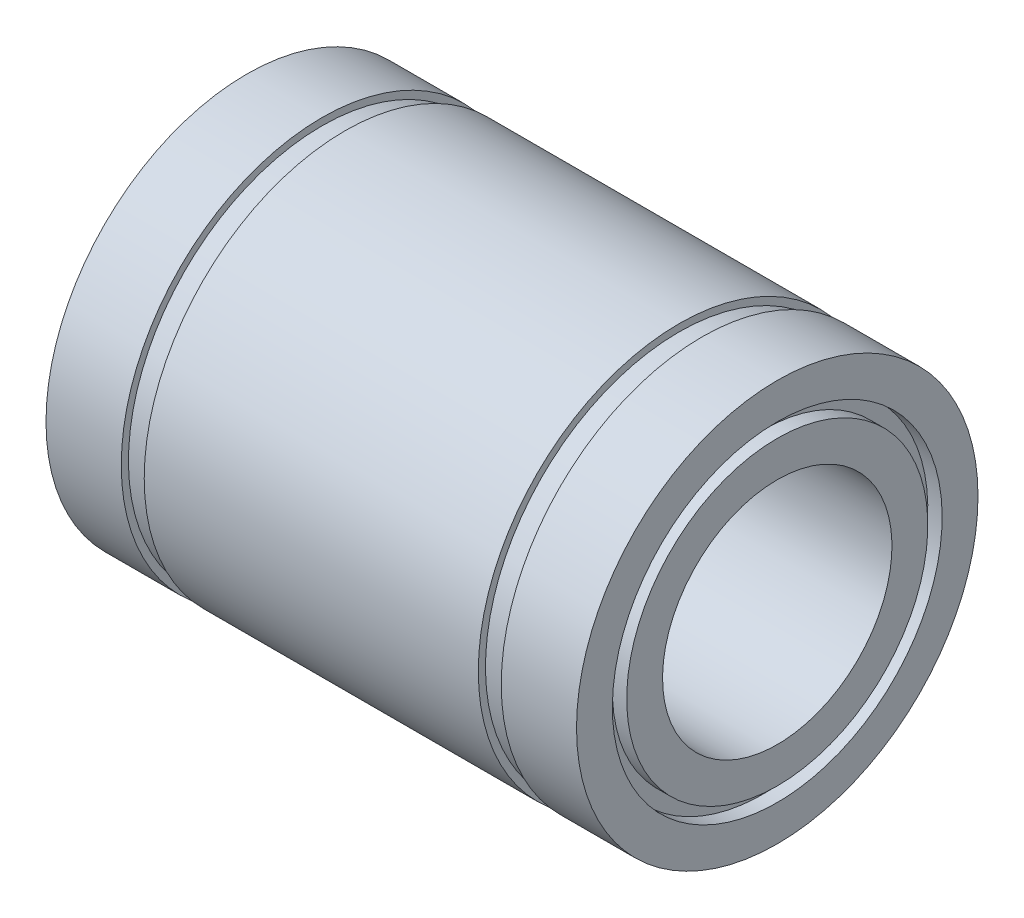
ISO-10303-21;
HEADER;
FILE_DESCRIPTION(('STEP AP214'),'2;1');
FILE_NAME('part.step','',(''),(''),'','','');
FILE_SCHEMA(('AUTOMOTIVE_DESIGN { 1 0 10303 214 1 1 1 1 }'));
ENDSEC;
DATA;
#1=APPLICATION_CONTEXT('core data for automotive mechanical design processes');
#2=APPLICATION_PROTOCOL_DEFINITION('international standard','automotive_design',2000,#1);
#3=PRODUCT_CONTEXT('',#1,'mechanical');
#4=PRODUCT('Part','Part','',(#3));
#5=PRODUCT_RELATED_PRODUCT_CATEGORY('part','',(#4));
#6=PRODUCT_DEFINITION_FORMATION('','',#4);
#7=PRODUCT_DEFINITION_CONTEXT('part definition',#1,'design');
#8=PRODUCT_DEFINITION('design','',#6,#7);
#9=PRODUCT_DEFINITION_SHAPE('','',#8);
#10=(LENGTH_UNIT() NAMED_UNIT(*) SI_UNIT(.MILLI.,.METRE.));
#11=(NAMED_UNIT(*) PLANE_ANGLE_UNIT() SI_UNIT($,.RADIAN.));
#12=(NAMED_UNIT(*) SI_UNIT($,.STERADIAN.) SOLID_ANGLE_UNIT());
#13=UNCERTAINTY_MEASURE_WITH_UNIT(LENGTH_MEASURE(1.E-05),#10,'distance_accuracy_value','');
#14=(GEOMETRIC_REPRESENTATION_CONTEXT(3) GLOBAL_UNCERTAINTY_ASSIGNED_CONTEXT((#13)) GLOBAL_UNIT_ASSIGNED_CONTEXT((#10,
#11,#12)) REPRESENTATION_CONTEXT('',''));
#15=CARTESIAN_POINT('',(0.,0.,0.));
#16=DIRECTION('',(0.,0.,1.));
#17=DIRECTION('',(1.,0.,0.));
#18=AXIS2_PLACEMENT_3D('',#15,#16,#17);
#19=CARTESIAN_POINT('',(-18.5,11.5,0.));
#20=DIRECTION('',(-1.,0.,0.));
#21=DIRECTION('',(0.,-1.,0.));
#22=AXIS2_PLACEMENT_3D('',#19,#20,#21);
#23=PLANE('',#22);
#24=CARTESIAN_POINT('',(-18.5,0.,0.));
#25=DIRECTION('',(1.,0.,0.));
#26=DIRECTION('',(0.,1.,0.));
#27=AXIS2_PLACEMENT_3D('',#24,#25,#26);
#28=CIRCLE('',#27,11.5);
#29=CARTESIAN_POINT('',(-18.5,11.5,0.));
#30=VERTEX_POINT('',#29);
#31=EDGE_CURVE('E121',#30,#30,#28,.T.);
#32=ORIENTED_EDGE('',*,*,#31,.T.);
#33=EDGE_LOOP('',(#32));
#34=FACE_BOUND('',#33,.T.);
#35=CARTESIAN_POINT('',(-18.5,0.,0.));
#36=DIRECTION('',(1.,0.,0.));
#37=DIRECTION('',(0.,1.,0.));
#38=AXIS2_PLACEMENT_3D('',#35,#36,#37);
#39=CIRCLE('',#38,14.);
#40=CARTESIAN_POINT('',(-18.5,14.,0.));
#41=VERTEX_POINT('',#40);
#42=EDGE_CURVE('E10',#41,#41,#39,.T.);
#43=ORIENTED_EDGE('',*,*,#42,.F.);
#44=EDGE_LOOP('',(#43));
#45=FACE_BOUND('',#44,.T.);
#46=ADVANCED_FACE('F38',(#34,#45),#23,.T.);
#47=CARTESIAN_POINT('',(0.,0.,0.));
#48=DIRECTION('',(1.,0.,0.));
#49=DIRECTION('',(0.,1.,0.));
#50=AXIS2_PLACEMENT_3D('',#47,#48,#49);
#51=CYLINDRICAL_SURFACE('',#50,14.);
#52=ORIENTED_EDGE('',*,*,#42,.T.);
#53=EDGE_LOOP('',(#52));
#54=FACE_BOUND('',#53,.T.);
#55=CARTESIAN_POINT('',(-13.25,0.,0.));
#56=DIRECTION('',(1.,0.,0.));
#57=DIRECTION('',(0.,1.,0.));
#58=AXIS2_PLACEMENT_3D('',#55,#56,#57);
#59=CIRCLE('',#58,14.);
#60=CARTESIAN_POINT('',(-13.25,14.,0.));
#61=VERTEX_POINT('',#60);
#62=EDGE_CURVE('E45',#61,#61,#59,.T.);
#63=ORIENTED_EDGE('',*,*,#62,.F.);
#64=EDGE_LOOP('',(#63));
#65=FACE_BOUND('',#64,.T.);
#66=ADVANCED_FACE('F140',(#54,#65),#51,.T.);
#67=CARTESIAN_POINT('',(-13.25,14.,0.));
#68=DIRECTION('',(1.,0.,0.));
#69=DIRECTION('',(0.,1.,0.));
#70=AXIS2_PLACEMENT_3D('',#67,#68,#69);
#71=PLANE('',#70);
#72=ORIENTED_EDGE('',*,*,#62,.T.);
#73=EDGE_LOOP('',(#72));
#74=FACE_BOUND('',#73,.T.);
#75=CARTESIAN_POINT('',(-13.25,0.,0.));
#76=DIRECTION('',(1.,0.,0.));
#77=DIRECTION('',(0.,1.,0.));
#78=AXIS2_PLACEMENT_3D('',#75,#76,#77);
#79=CIRCLE('',#78,13.5);
#80=CARTESIAN_POINT('',(-13.25,13.5,0.));
#81=VERTEX_POINT('',#80);
#82=EDGE_CURVE('E52',#81,#81,#79,.T.);
#83=ORIENTED_EDGE('',*,*,#82,.F.);
#84=EDGE_LOOP('',(#83));
#85=FACE_BOUND('',#84,.T.);
#86=ADVANCED_FACE('F144',(#74,#85),#71,.T.);
#87=CARTESIAN_POINT('',(0.,0.,0.));
#88=DIRECTION('',(1.,0.,0.));
#89=DIRECTION('',(0.,1.,0.));
#90=AXIS2_PLACEMENT_3D('',#87,#88,#89);
#91=CYLINDRICAL_SURFACE('',#90,13.5);
#92=ORIENTED_EDGE('',*,*,#82,.T.);
#93=EDGE_LOOP('',(#92));
#94=FACE_BOUND('',#93,.T.);
#95=CARTESIAN_POINT('',(-11.65,0.,0.));
#96=DIRECTION('',(1.,0.,0.));
#97=DIRECTION('',(0.,1.,0.));
#98=AXIS2_PLACEMENT_3D('',#95,#96,#97);
#99=CIRCLE('',#98,13.5);
#100=CARTESIAN_POINT('',(-11.65,13.5,0.));
#101=VERTEX_POINT('',#100);
#102=EDGE_CURVE('E58',#101,#101,#99,.T.);
#103=ORIENTED_EDGE('',*,*,#102,.F.);
#104=EDGE_LOOP('',(#103));
#105=FACE_BOUND('',#104,.T.);
#106=ADVANCED_FACE('F148',(#94,#105),#91,.T.);
#107=CARTESIAN_POINT('',(-11.65,13.5,0.));
#108=DIRECTION('',(-1.,0.,0.));
#109=DIRECTION('',(0.,-1.,0.));
#110=AXIS2_PLACEMENT_3D('',#107,#108,#109);
#111=PLANE('',#110);
#112=ORIENTED_EDGE('',*,*,#102,.T.);
#113=EDGE_LOOP('',(#112));
#114=FACE_BOUND('',#113,.T.);
#115=CARTESIAN_POINT('',(-11.65,0.,0.));
#116=DIRECTION('',(1.,0.,0.));
#117=DIRECTION('',(0.,1.,0.));
#118=AXIS2_PLACEMENT_3D('',#115,#116,#117);
#119=CIRCLE('',#118,14.);
#120=CARTESIAN_POINT('',(-11.65,14.,0.));
#121=VERTEX_POINT('',#120);
#122=EDGE_CURVE('E64',#121,#121,#119,.T.);
#123=ORIENTED_EDGE('',*,*,#122,.F.);
#124=EDGE_LOOP('',(#123));
#125=FACE_BOUND('',#124,.T.);
#126=ADVANCED_FACE('F154',(#114,#125),#111,.T.);
#127=CARTESIAN_POINT('',(0.,0.,0.));
#128=DIRECTION('',(1.,0.,0.));
#129=DIRECTION('',(0.,1.,0.));
#130=AXIS2_PLACEMENT_3D('',#127,#128,#129);
#131=CYLINDRICAL_SURFACE('',#130,14.);
#132=ORIENTED_EDGE('',*,*,#122,.T.);
#133=EDGE_LOOP('',(#132));
#134=FACE_BOUND('',#133,.T.);
#135=CARTESIAN_POINT('',(11.65,0.,0.));
#136=DIRECTION('',(1.,0.,0.));
#137=DIRECTION('',(0.,1.,0.));
#138=AXIS2_PLACEMENT_3D('',#135,#136,#137);
#139=CIRCLE('',#138,14.);
#140=CARTESIAN_POINT('',(11.65,14.,0.));
#141=VERTEX_POINT('',#140);
#142=EDGE_CURVE('E68',#141,#141,#139,.T.);
#143=ORIENTED_EDGE('',*,*,#142,.F.);
#144=EDGE_LOOP('',(#143));
#145=FACE_BOUND('',#144,.T.);
#146=ADVANCED_FACE('F158',(#134,#145),#131,.T.);
#147=CARTESIAN_POINT('',(11.65,14.,0.));
#148=DIRECTION('',(1.,0.,0.));
#149=DIRECTION('',(0.,1.,0.));
#150=AXIS2_PLACEMENT_3D('',#147,#148,#149);
#151=PLANE('',#150);
#152=ORIENTED_EDGE('',*,*,#142,.T.);
#153=EDGE_LOOP('',(#152));
#154=FACE_BOUND('',#153,.T.);
#155=CARTESIAN_POINT('',(11.65,0.,0.));
#156=DIRECTION('',(1.,0.,0.));
#157=DIRECTION('',(0.,1.,0.));
#158=AXIS2_PLACEMENT_3D('',#155,#156,#157);
#159=CIRCLE('',#158,13.5);
#160=CARTESIAN_POINT('',(11.65,13.5,0.));
#161=VERTEX_POINT('',#160);
#162=EDGE_CURVE('E72',#161,#161,#159,.T.);
#163=ORIENTED_EDGE('',*,*,#162,.F.);
#164=EDGE_LOOP('',(#163));
#165=FACE_BOUND('',#164,.T.);
#166=ADVANCED_FACE('F162',(#154,#165),#151,.T.);
#167=CARTESIAN_POINT('',(0.,0.,0.));
#168=DIRECTION('',(1.,0.,0.));
#169=DIRECTION('',(0.,1.,0.));
#170=AXIS2_PLACEMENT_3D('',#167,#168,#169);
#171=CYLINDRICAL_SURFACE('',#170,13.5);
#172=ORIENTED_EDGE('',*,*,#162,.T.);
#173=EDGE_LOOP('',(#172));
#174=FACE_BOUND('',#173,.T.);
#175=CARTESIAN_POINT('',(13.25,0.,0.));
#176=DIRECTION('',(1.,0.,0.));
#177=DIRECTION('',(0.,1.,0.));
#178=AXIS2_PLACEMENT_3D('',#175,#176,#177);
#179=CIRCLE('',#178,13.5);
#180=CARTESIAN_POINT('',(13.25,13.5,0.));
#181=VERTEX_POINT('',#180);
#182=EDGE_CURVE('E75',#181,#181,#179,.T.);
#183=ORIENTED_EDGE('',*,*,#182,.F.);
#184=EDGE_LOOP('',(#183));
#185=FACE_BOUND('',#184,.T.);
#186=ADVANCED_FACE('F166',(#174,#185),#171,.T.);
#187=CARTESIAN_POINT('',(13.25,13.5,0.));
#188=DIRECTION('',(-1.,0.,0.));
#189=DIRECTION('',(0.,-1.,0.));
#190=AXIS2_PLACEMENT_3D('',#187,#188,#189);
#191=PLANE('',#190);
#192=ORIENTED_EDGE('',*,*,#182,.T.);
#193=EDGE_LOOP('',(#192));
#194=FACE_BOUND('',#193,.T.);
#195=CARTESIAN_POINT('',(13.25,0.,0.));
#196=DIRECTION('',(1.,0.,0.));
#197=DIRECTION('',(0.,1.,0.));
#198=AXIS2_PLACEMENT_3D('',#195,#196,#197);
#199=CIRCLE('',#198,14.);
#200=CARTESIAN_POINT('',(13.25,14.,0.));
#201=VERTEX_POINT('',#200);
#202=EDGE_CURVE('E79',#201,#201,#199,.T.);
#203=ORIENTED_EDGE('',*,*,#202,.F.);
#204=EDGE_LOOP('',(#203));
#205=FACE_BOUND('',#204,.T.);
#206=ADVANCED_FACE('F170',(#194,#205),#191,.T.);
#207=CARTESIAN_POINT('',(0.,0.,0.));
#208=DIRECTION('',(1.,0.,0.));
#209=DIRECTION('',(0.,1.,0.));
#210=AXIS2_PLACEMENT_3D('',#207,#208,#209);
#211=CYLINDRICAL_SURFACE('',#210,14.);
#212=ORIENTED_EDGE('',*,*,#202,.T.);
#213=EDGE_LOOP('',(#212));
#214=FACE_BOUND('',#213,.T.);
#215=CARTESIAN_POINT('',(18.5,0.,0.));
#216=DIRECTION('',(1.,0.,0.));
#217=DIRECTION('',(0.,1.,0.));
#218=AXIS2_PLACEMENT_3D('',#215,#216,#217);
#219=CIRCLE('',#218,14.);
#220=CARTESIAN_POINT('',(18.5,14.,0.));
#221=VERTEX_POINT('',#220);
#222=EDGE_CURVE('E82',#221,#221,#219,.T.);
#223=ORIENTED_EDGE('',*,*,#222,.F.);
#224=EDGE_LOOP('',(#223));
#225=FACE_BOUND('',#224,.T.);
#226=ADVANCED_FACE('F174',(#214,#225),#211,.T.);
#227=CARTESIAN_POINT('',(18.5,14.,0.));
#228=DIRECTION('',(1.,0.,0.));
#229=DIRECTION('',(0.,1.,0.));
#230=AXIS2_PLACEMENT_3D('',#227,#228,#229);
#231=PLANE('',#230);
#232=ORIENTED_EDGE('',*,*,#222,.T.);
#233=EDGE_LOOP('',(#232));
#234=FACE_BOUND('',#233,.T.);
#235=CARTESIAN_POINT('',(18.5,0.,0.));
#236=DIRECTION('',(1.,0.,0.));
#237=DIRECTION('',(0.,1.,0.));
#238=AXIS2_PLACEMENT_3D('',#235,#236,#237);
#239=CIRCLE('',#238,11.5);
#240=CARTESIAN_POINT('',(18.5,11.5,0.));
#241=VERTEX_POINT('',#240);
#242=EDGE_CURVE('E86',#241,#241,#239,.T.);
#243=ORIENTED_EDGE('',*,*,#242,.F.);
#244=EDGE_LOOP('',(#243));
#245=FACE_BOUND('',#244,.T.);
#246=ADVANCED_FACE('F178',(#234,#245),#231,.T.);
#247=CARTESIAN_POINT('',(0.,0.,0.));
#248=DIRECTION('',(1.,0.,0.));
#249=DIRECTION('',(0.,1.,0.));
#250=AXIS2_PLACEMENT_3D('',#247,#248,#249);
#251=CYLINDRICAL_SURFACE('',#250,11.5);
#252=ORIENTED_EDGE('',*,*,#242,.T.);
#253=EDGE_LOOP('',(#252));
#254=FACE_BOUND('',#253,.T.);
#255=CARTESIAN_POINT('',(17.5,0.,0.));
#256=DIRECTION('',(1.,0.,0.));
#257=DIRECTION('',(0.,1.,0.));
#258=AXIS2_PLACEMENT_3D('',#255,#256,#257);
#259=CIRCLE('',#258,11.5);
#260=CARTESIAN_POINT('',(17.5,11.5,0.));
#261=VERTEX_POINT('',#260);
#262=EDGE_CURVE('E90',#261,#261,#259,.T.);
#263=ORIENTED_EDGE('',*,*,#262,.F.);
#264=EDGE_LOOP('',(#263));
#265=FACE_BOUND('',#264,.T.);
#266=ADVANCED_FACE('F182',(#254,#265),#251,.F.);
#267=CARTESIAN_POINT('',(17.5,11.5,0.));
#268=DIRECTION('',(1.,0.,0.));
#269=DIRECTION('',(0.,1.,0.));
#270=AXIS2_PLACEMENT_3D('',#267,#268,#269);
#271=PLANE('',#270);
#272=ORIENTED_EDGE('',*,*,#262,.T.);
#273=EDGE_LOOP('',(#272));
#274=FACE_BOUND('',#273,.T.);
#275=CARTESIAN_POINT('',(17.5,0.,0.));
#276=DIRECTION('',(1.,0.,0.));
#277=DIRECTION('',(0.,1.,0.));
#278=AXIS2_PLACEMENT_3D('',#275,#276,#277);
#279=CIRCLE('',#278,10.5);
#280=CARTESIAN_POINT('',(17.5,10.5,0.));
#281=VERTEX_POINT('',#280);
#282=EDGE_CURVE('E94',#281,#281,#279,.T.);
#283=ORIENTED_EDGE('',*,*,#282,.F.);
#284=EDGE_LOOP('',(#283));
#285=FACE_BOUND('',#284,.T.);
#286=ADVANCED_FACE('F186',(#274,#285),#271,.T.);
#287=CARTESIAN_POINT('',(0.,0.,0.));
#288=DIRECTION('',(1.,0.,0.));
#289=DIRECTION('',(0.,1.,0.));
#290=AXIS2_PLACEMENT_3D('',#287,#288,#289);
#291=CYLINDRICAL_SURFACE('',#290,10.5);
#292=ORIENTED_EDGE('',*,*,#282,.T.);
#293=EDGE_LOOP('',(#292));
#294=FACE_BOUND('',#293,.T.);
#295=CARTESIAN_POINT('',(18.5,0.,0.));
#296=DIRECTION('',(1.,0.,0.));
#297=DIRECTION('',(0.,1.,0.));
#298=AXIS2_PLACEMENT_3D('',#295,#296,#297);
#299=CIRCLE('',#298,10.5);
#300=CARTESIAN_POINT('',(18.5,10.5,0.));
#301=VERTEX_POINT('',#300);
#302=EDGE_CURVE('E98',#301,#301,#299,.T.);
#303=ORIENTED_EDGE('',*,*,#302,.F.);
#304=EDGE_LOOP('',(#303));
#305=FACE_BOUND('',#304,.T.);
#306=ADVANCED_FACE('F190',(#294,#305),#291,.T.);
#307=CARTESIAN_POINT('',(18.5,10.5,0.));
#308=DIRECTION('',(1.,0.,0.));
#309=DIRECTION('',(0.,1.,0.));
#310=AXIS2_PLACEMENT_3D('',#307,#308,#309);
#311=PLANE('',#310);
#312=ORIENTED_EDGE('',*,*,#302,.T.);
#313=EDGE_LOOP('',(#312));
#314=FACE_BOUND('',#313,.T.);
#315=CARTESIAN_POINT('',(18.5,0.,0.));
#316=DIRECTION('',(1.,0.,0.));
#317=DIRECTION('',(0.,1.,0.));
#318=AXIS2_PLACEMENT_3D('',#315,#316,#317);
#319=CIRCLE('',#318,8.);
#320=CARTESIAN_POINT('',(18.5,8.,0.));
#321=VERTEX_POINT('',#320);
#322=EDGE_CURVE('E102',#321,#321,#319,.T.);
#323=ORIENTED_EDGE('',*,*,#322,.F.);
#324=EDGE_LOOP('',(#323));
#325=FACE_BOUND('',#324,.T.);
#326=ADVANCED_FACE('F194',(#314,#325),#311,.T.);
#327=CARTESIAN_POINT('',(0.,0.,0.));
#328=DIRECTION('',(1.,0.,0.));
#329=DIRECTION('',(0.,1.,0.));
#330=AXIS2_PLACEMENT_3D('',#327,#328,#329);
#331=CYLINDRICAL_SURFACE('',#330,8.);
#332=ORIENTED_EDGE('',*,*,#322,.T.);
#333=EDGE_LOOP('',(#332));
#334=FACE_BOUND('',#333,.T.);
#335=CARTESIAN_POINT('',(-18.5,0.,0.));
#336=DIRECTION('',(1.,0.,0.));
#337=DIRECTION('',(0.,1.,0.));
#338=AXIS2_PLACEMENT_3D('',#335,#336,#337);
#339=CIRCLE('',#338,8.);
#340=CARTESIAN_POINT('',(-18.5,8.,0.));
#341=VERTEX_POINT('',#340);
#342=EDGE_CURVE('E106',#341,#341,#339,.T.);
#343=ORIENTED_EDGE('',*,*,#342,.F.);
#344=EDGE_LOOP('',(#343));
#345=FACE_BOUND('',#344,.T.);
#346=ADVANCED_FACE('F198',(#334,#345),#331,.F.);
#347=CARTESIAN_POINT('',(-18.5,8.,0.));
#348=DIRECTION('',(-1.,0.,0.));
#349=DIRECTION('',(0.,-1.,0.));
#350=AXIS2_PLACEMENT_3D('',#347,#348,#349);
#351=PLANE('',#350);
#352=ORIENTED_EDGE('',*,*,#342,.T.);
#353=EDGE_LOOP('',(#352));
#354=FACE_BOUND('',#353,.T.);
#355=CARTESIAN_POINT('',(-18.5,0.,0.));
#356=DIRECTION('',(1.,0.,0.));
#357=DIRECTION('',(0.,1.,0.));
#358=AXIS2_PLACEMENT_3D('',#355,#356,#357);
#359=CIRCLE('',#358,10.5);
#360=CARTESIAN_POINT('',(-18.5,10.5,0.));
#361=VERTEX_POINT('',#360);
#362=EDGE_CURVE('E110',#361,#361,#359,.T.);
#363=ORIENTED_EDGE('',*,*,#362,.F.);
#364=EDGE_LOOP('',(#363));
#365=FACE_BOUND('',#364,.T.);
#366=ADVANCED_FACE('F202',(#354,#365),#351,.T.);
#367=CARTESIAN_POINT('',(0.,0.,0.));
#368=DIRECTION('',(1.,0.,0.));
#369=DIRECTION('',(0.,1.,0.));
#370=AXIS2_PLACEMENT_3D('',#367,#368,#369);
#371=CYLINDRICAL_SURFACE('',#370,10.5);
#372=ORIENTED_EDGE('',*,*,#362,.T.);
#373=EDGE_LOOP('',(#372));
#374=FACE_BOUND('',#373,.T.);
#375=CARTESIAN_POINT('',(-17.5,0.,0.));
#376=DIRECTION('',(1.,0.,0.));
#377=DIRECTION('',(0.,1.,0.));
#378=AXIS2_PLACEMENT_3D('',#375,#376,#377);
#379=CIRCLE('',#378,10.5);
#380=CARTESIAN_POINT('',(-17.5,10.5,0.));
#381=VERTEX_POINT('',#380);
#382=EDGE_CURVE('E113',#381,#381,#379,.T.);
#383=ORIENTED_EDGE('',*,*,#382,.F.);
#384=EDGE_LOOP('',(#383));
#385=FACE_BOUND('',#384,.T.);
#386=ADVANCED_FACE('F136',(#374,#385),#371,.T.);
#387=CARTESIAN_POINT('',(-17.5,11.5,0.));
#388=DIRECTION('',(-1.,0.,0.));
#389=DIRECTION('',(0.,-1.,0.));
#390=AXIS2_PLACEMENT_3D('',#387,#388,#389);
#391=PLANE('',#390);
#392=ORIENTED_EDGE('',*,*,#382,.T.);
#393=EDGE_LOOP('',(#392));
#394=FACE_BOUND('',#393,.T.);
#395=CARTESIAN_POINT('',(-17.5,0.,0.));
#396=DIRECTION('',(1.,0.,0.));
#397=DIRECTION('',(0.,1.,0.));
#398=AXIS2_PLACEMENT_3D('',#395,#396,#397);
#399=CIRCLE('',#398,11.5);
#400=CARTESIAN_POINT('',(-17.5,11.5,0.));
#401=VERTEX_POINT('',#400);
#402=EDGE_CURVE('E117',#401,#401,#399,.T.);
#403=ORIENTED_EDGE('',*,*,#402,.F.);
#404=EDGE_LOOP('',(#403));
#405=FACE_BOUND('',#404,.T.);
#406=ADVANCED_FACE('F130',(#394,#405),#391,.T.);
#407=CARTESIAN_POINT('',(0.,0.,0.));
#408=DIRECTION('',(1.,0.,0.));
#409=DIRECTION('',(0.,1.,0.));
#410=AXIS2_PLACEMENT_3D('',#407,#408,#409);
#411=CYLINDRICAL_SURFACE('',#410,11.5);
#412=ORIENTED_EDGE('',*,*,#402,.T.);
#413=EDGE_LOOP('',(#412));
#414=FACE_BOUND('',#413,.T.);
#415=ORIENTED_EDGE('',*,*,#31,.F.);
#416=EDGE_LOOP('',(#415));
#417=FACE_BOUND('',#416,.T.);
#418=ADVANCED_FACE('F128',(#414,#417),#411,.F.);
#419=CLOSED_SHELL('',(#46,#66,#86,#106,#126,#146,#166,#186,#206,#226,#246,#266,#286,#306,#326,
#346,#366,#386,#406,#418));
#420=MANIFOLD_SOLID_BREP('B2',#419);
#421=ADVANCED_BREP_SHAPE_REPRESENTATION('',(#18,#420),#14);
#422=SHAPE_DEFINITION_REPRESENTATION(#9,#421);
ENDSEC;
END-ISO-10303-21;
